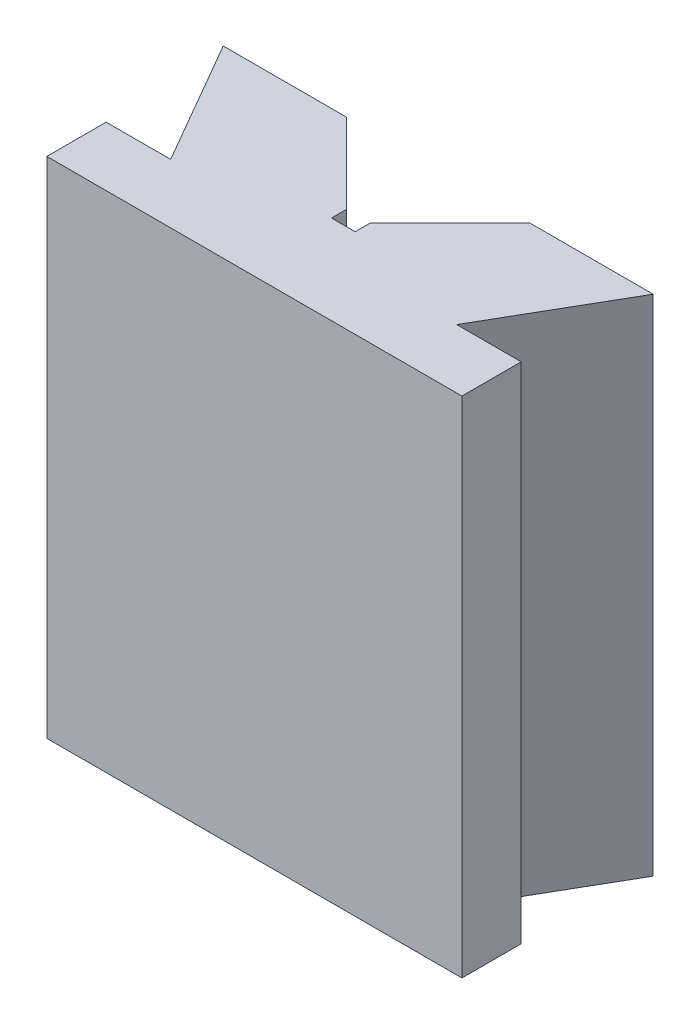
ISO-10303-21;
HEADER;
FILE_DESCRIPTION(('STEP AP214'),'2;1');
FILE_NAME('part.step','',(''),(''),'','','');
FILE_SCHEMA(('AUTOMOTIVE_DESIGN { 1 0 10303 214 1 1 1 1 }'));
ENDSEC;
DATA;
#1=APPLICATION_CONTEXT('core data for automotive mechanical design processes');
#2=APPLICATION_PROTOCOL_DEFINITION('international standard','automotive_design',2000,#1);
#3=PRODUCT_CONTEXT('',#1,'mechanical');
#4=PRODUCT('Part','Part','',(#3));
#5=PRODUCT_RELATED_PRODUCT_CATEGORY('part','',(#4));
#6=PRODUCT_DEFINITION_FORMATION('','',#4);
#7=PRODUCT_DEFINITION_CONTEXT('part definition',#1,'design');
#8=PRODUCT_DEFINITION('design','',#6,#7);
#9=PRODUCT_DEFINITION_SHAPE('','',#8);
#10=(LENGTH_UNIT() NAMED_UNIT(*) SI_UNIT(.MILLI.,.METRE.));
#11=(NAMED_UNIT(*) PLANE_ANGLE_UNIT() SI_UNIT($,.RADIAN.));
#12=(NAMED_UNIT(*) SI_UNIT($,.STERADIAN.) SOLID_ANGLE_UNIT());
#13=UNCERTAINTY_MEASURE_WITH_UNIT(LENGTH_MEASURE(1.E-05),#10,'distance_accuracy_value','');
#14=(GEOMETRIC_REPRESENTATION_CONTEXT(3) GLOBAL_UNCERTAINTY_ASSIGNED_CONTEXT((#13)) GLOBAL_UNIT_ASSIGNED_CONTEXT((#10,
#11,#12)) REPRESENTATION_CONTEXT('',''));
#15=CARTESIAN_POINT('',(0.,0.,0.));
#16=DIRECTION('',(0.,0.,1.));
#17=DIRECTION('',(1.,0.,0.));
#18=AXIS2_PLACEMENT_3D('',#15,#16,#17);
#19=CARTESIAN_POINT('',(-2.49999999999999,170.,-62.));
#20=DIRECTION('',(0.,0.,-1.));
#21=DIRECTION('',(-1.,0.,0.));
#22=AXIS2_PLACEMENT_3D('',#19,#20,#21);
#23=PLANE('',#22);
#24=DIRECTION('',(1.,0.,0.));
#25=VECTOR('',#24,1.);
#26=CARTESIAN_POINT('',(-2.49999999999999,0.,-62.));
#27=LINE('',#26,#25);
#28=CARTESIAN_POINT('',(-2.49999999999999,0.,-62.));
#29=VERTEX_POINT('',#28);
#30=CARTESIAN_POINT('',(38.9999999999999,0.,-62.));
#31=VERTEX_POINT('',#30);
#32=EDGE_CURVE('E167',#29,#31,#27,.T.);
#33=ORIENTED_EDGE('',*,*,#32,.F.);
#34=DIRECTION('',(0.,-1.,0.));
#35=VECTOR('',#34,1.);
#36=CARTESIAN_POINT('',(-2.49999999999999,170.,-62.));
#37=LINE('',#36,#35);
#38=CARTESIAN_POINT('',(-2.49999999999999,170.,-62.));
#39=VERTEX_POINT('',#38);
#40=EDGE_CURVE('E11',#39,#29,#37,.T.);
#41=ORIENTED_EDGE('',*,*,#40,.F.);
#42=DIRECTION('',(1.,0.,0.));
#43=VECTOR('',#42,1.);
#44=CARTESIAN_POINT('',(-2.49999999999999,170.,-62.));
#45=LINE('',#44,#43);
#46=CARTESIAN_POINT('',(38.9999999999999,170.,-62.));
#47=VERTEX_POINT('',#46);
#48=EDGE_CURVE('E199',#39,#47,#45,.T.);
#49=ORIENTED_EDGE('',*,*,#48,.T.);
#50=DIRECTION('',(0.,-1.,0.));
#51=VECTOR('',#50,1.);
#52=CARTESIAN_POINT('',(38.9999999999999,170.,-62.));
#53=LINE('',#52,#51);
#54=EDGE_CURVE('E38',#47,#31,#53,.T.);
#55=ORIENTED_EDGE('',*,*,#54,.T.);
#56=EDGE_LOOP('',(#33,#41,#49,#55));
#57=FACE_BOUND('',#56,.T.);
#58=ADVANCED_FACE('F35',(#57),#23,.T.);
#59=CARTESIAN_POINT('',(21.7487113059646,170.,-20.));
#60=DIRECTION('',(-0.866025403784436,0.,0.500000000000004));
#61=DIRECTION('',(0.500000000000004,0.,0.866025403784436));
#62=AXIS2_PLACEMENT_3D('',#59,#60,#61);
#63=PLANE('',#62);
#64=DIRECTION('',(-0.500000000000004,0.,-0.866025403784436));
#65=VECTOR('',#64,1.);
#66=CARTESIAN_POINT('',(21.7487113059646,0.,-20.));
#67=LINE('',#66,#65);
#68=CARTESIAN_POINT('',(21.7487113059646,0.,-20.));
#69=VERTEX_POINT('',#68);
#70=EDGE_CURVE('E197',#69,#29,#67,.T.);
#71=ORIENTED_EDGE('',*,*,#70,.F.);
#72=DIRECTION('',(0.,-1.,0.));
#73=VECTOR('',#72,1.);
#74=CARTESIAN_POINT('',(21.7487113059646,170.,-20.));
#75=LINE('',#74,#73);
#76=CARTESIAN_POINT('',(21.7487113059646,170.,-20.));
#77=VERTEX_POINT('',#76);
#78=EDGE_CURVE('E44',#77,#69,#75,.T.);
#79=ORIENTED_EDGE('',*,*,#78,.F.);
#80=DIRECTION('',(-0.500000000000004,0.,-0.866025403784436));
#81=VECTOR('',#80,1.);
#82=CARTESIAN_POINT('',(21.7487113059646,170.,-20.));
#83=LINE('',#82,#81);
#84=EDGE_CURVE('E156',#77,#39,#83,.T.);
#85=ORIENTED_EDGE('',*,*,#84,.T.);
#86=ORIENTED_EDGE('',*,*,#40,.T.);
#87=EDGE_LOOP('',(#71,#79,#85,#86));
#88=FACE_BOUND('',#87,.T.);
#89=ADVANCED_FACE('F229',(#88),#63,.T.);
#90=CARTESIAN_POINT('',(0.,170.,-20.));
#91=DIRECTION('',(0.,0.,-1.));
#92=DIRECTION('',(-1.,0.,0.));
#93=AXIS2_PLACEMENT_3D('',#90,#91,#92);
#94=PLANE('',#93);
#95=DIRECTION('',(1.,0.,0.));
#96=VECTOR('',#95,1.);
#97=CARTESIAN_POINT('',(0.,0.,-20.));
#98=LINE('',#97,#96);
#99=CARTESIAN_POINT('',(0.,0.,-20.));
#100=VERTEX_POINT('',#99);
#101=EDGE_CURVE('E145',#100,#69,#98,.T.);
#102=ORIENTED_EDGE('',*,*,#101,.F.);
#103=DIRECTION('',(0.,-1.,0.));
#104=VECTOR('',#103,1.);
#105=CARTESIAN_POINT('',(0.,170.,-20.));
#106=LINE('',#105,#104);
#107=CARTESIAN_POINT('',(0.,170.,-20.));
#108=VERTEX_POINT('',#107);
#109=EDGE_CURVE('E140',#108,#100,#106,.T.);
#110=ORIENTED_EDGE('',*,*,#109,.F.);
#111=DIRECTION('',(1.,0.,0.));
#112=VECTOR('',#111,1.);
#113=CARTESIAN_POINT('',(0.,170.,-20.));
#114=LINE('',#113,#112);
#115=EDGE_CURVE('E143',#108,#77,#114,.T.);
#116=ORIENTED_EDGE('',*,*,#115,.T.);
#117=ORIENTED_EDGE('',*,*,#78,.T.);
#118=EDGE_LOOP('',(#102,#110,#116,#117));
#119=FACE_BOUND('',#118,.T.);
#120=ADVANCED_FACE('F142',(#119),#94,.T.);
#121=CARTESIAN_POINT('',(0.,170.,0.));
#122=DIRECTION('',(-1.,0.,0.));
#123=DIRECTION('',(0.,0.,1.));
#124=AXIS2_PLACEMENT_3D('',#121,#122,#123);
#125=PLANE('',#124);
#126=DIRECTION('',(0.,0.,-1.));
#127=VECTOR('',#126,1.);
#128=CARTESIAN_POINT('',(0.,0.,0.));
#129=LINE('',#128,#127);
#130=CARTESIAN_POINT('',(0.,0.,0.));
#131=VERTEX_POINT('',#130);
#132=EDGE_CURVE('E194',#131,#100,#129,.T.);
#133=ORIENTED_EDGE('',*,*,#132,.F.);
#134=DIRECTION('',(0.,-1.,0.));
#135=VECTOR('',#134,1.);
#136=CARTESIAN_POINT('',(0.,170.,0.));
#137=LINE('',#136,#135);
#138=CARTESIAN_POINT('',(0.,170.,0.));
#139=VERTEX_POINT('',#138);
#140=EDGE_CURVE('E150',#139,#131,#137,.T.);
#141=ORIENTED_EDGE('',*,*,#140,.F.);
#142=DIRECTION('',(0.,0.,-1.));
#143=VECTOR('',#142,1.);
#144=CARTESIAN_POINT('',(0.,170.,0.));
#145=LINE('',#144,#143);
#146=EDGE_CURVE('E155',#139,#108,#145,.T.);
#147=ORIENTED_EDGE('',*,*,#146,.T.);
#148=ORIENTED_EDGE('',*,*,#109,.T.);
#149=EDGE_LOOP('',(#133,#141,#147,#148));
#150=FACE_BOUND('',#149,.T.);
#151=ADVANCED_FACE('F158',(#150),#125,.T.);
#152=CARTESIAN_POINT('',(0.,170.,0.));
#153=DIRECTION('',(0.,0.,-1.));
#154=DIRECTION('',(-1.,0.,0.));
#155=AXIS2_PLACEMENT_3D('',#152,#153,#154);
#156=PLANE('',#155);
#157=DIRECTION('',(1.,0.,0.));
#158=VECTOR('',#157,1.);
#159=CARTESIAN_POINT('',(0.,0.,0.));
#160=LINE('',#159,#158);
#161=CARTESIAN_POINT('',(140.,0.,0.));
#162=VERTEX_POINT('',#161);
#163=EDGE_CURVE('E192',#131,#162,#160,.T.);
#164=ORIENTED_EDGE('',*,*,#163,.T.);
#165=DIRECTION('',(0.,-1.,0.));
#166=VECTOR('',#165,1.);
#167=CARTESIAN_POINT('',(140.,170.,0.));
#168=LINE('',#167,#166);
#169=CARTESIAN_POINT('',(140.,170.,0.));
#170=VERTEX_POINT('',#169);
#171=EDGE_CURVE('E203',#170,#162,#168,.T.);
#172=ORIENTED_EDGE('',*,*,#171,.F.);
#173=DIRECTION('',(1.,0.,0.));
#174=VECTOR('',#173,1.);
#175=CARTESIAN_POINT('',(0.,170.,0.));
#176=LINE('',#175,#174);
#177=EDGE_CURVE('E160',#139,#170,#176,.T.);
#178=ORIENTED_EDGE('',*,*,#177,.F.);
#179=ORIENTED_EDGE('',*,*,#140,.T.);
#180=EDGE_LOOP('',(#164,#172,#178,#179));
#181=FACE_BOUND('',#180,.T.);
#182=ADVANCED_FACE('F242',(#181),#156,.F.);
#183=CARTESIAN_POINT('',(140.,170.,0.));
#184=DIRECTION('',(-1.,0.,0.));
#185=DIRECTION('',(0.,0.,1.));
#186=AXIS2_PLACEMENT_3D('',#183,#184,#185);
#187=PLANE('',#186);
#188=DIRECTION('',(0.,0.,-1.));
#189=VECTOR('',#188,1.);
#190=CARTESIAN_POINT('',(140.,0.,0.));
#191=LINE('',#190,#189);
#192=CARTESIAN_POINT('',(140.,0.,-20.));
#193=VERTEX_POINT('',#192);
#194=EDGE_CURVE('E190',#162,#193,#191,.T.);
#195=ORIENTED_EDGE('',*,*,#194,.T.);
#196=DIRECTION('',(0.,-1.,0.));
#197=VECTOR('',#196,1.);
#198=CARTESIAN_POINT('',(140.,170.,-20.));
#199=LINE('',#198,#197);
#200=CARTESIAN_POINT('',(140.,170.,-20.));
#201=VERTEX_POINT('',#200);
#202=EDGE_CURVE('E206',#201,#193,#199,.T.);
#203=ORIENTED_EDGE('',*,*,#202,.F.);
#204=DIRECTION('',(0.,0.,-1.));
#205=VECTOR('',#204,1.);
#206=CARTESIAN_POINT('',(140.,170.,0.));
#207=LINE('',#206,#205);
#208=EDGE_CURVE('E162',#170,#201,#207,.T.);
#209=ORIENTED_EDGE('',*,*,#208,.F.);
#210=ORIENTED_EDGE('',*,*,#171,.T.);
#211=EDGE_LOOP('',(#195,#203,#209,#210));
#212=FACE_BOUND('',#211,.T.);
#213=ADVANCED_FACE('F245',(#212),#187,.F.);
#214=CARTESIAN_POINT('',(140.,170.,-20.));
#215=DIRECTION('',(0.,0.,1.));
#216=DIRECTION('',(1.,0.,0.));
#217=AXIS2_PLACEMENT_3D('',#214,#215,#216);
#218=PLANE('',#217);
#219=DIRECTION('',(-1.,0.,0.));
#220=VECTOR('',#219,1.);
#221=CARTESIAN_POINT('',(140.,0.,-20.));
#222=LINE('',#221,#220);
#223=CARTESIAN_POINT('',(118.251288694035,0.,-20.));
#224=VERTEX_POINT('',#223);
#225=EDGE_CURVE('E188',#193,#224,#222,.T.);
#226=ORIENTED_EDGE('',*,*,#225,.T.);
#227=DIRECTION('',(0.,-1.,0.));
#228=VECTOR('',#227,1.);
#229=CARTESIAN_POINT('',(118.251288694035,170.,-20.));
#230=LINE('',#229,#228);
#231=CARTESIAN_POINT('',(118.251288694035,170.,-20.));
#232=VERTEX_POINT('',#231);
#233=EDGE_CURVE('E209',#232,#224,#230,.T.);
#234=ORIENTED_EDGE('',*,*,#233,.F.);
#235=DIRECTION('',(-1.,0.,0.));
#236=VECTOR('',#235,1.);
#237=CARTESIAN_POINT('',(140.,170.,-20.));
#238=LINE('',#237,#236);
#239=EDGE_CURVE('E399',#201,#232,#238,.T.);
#240=ORIENTED_EDGE('',*,*,#239,.F.);
#241=ORIENTED_EDGE('',*,*,#202,.T.);
#242=EDGE_LOOP('',(#226,#234,#240,#241));
#243=FACE_BOUND('',#242,.T.);
#244=ADVANCED_FACE('F249',(#243),#218,.F.);
#245=CARTESIAN_POINT('',(118.251288694035,170.,-20.));
#246=DIRECTION('',(-0.866025403784436,0.,-0.500000000000004));
#247=DIRECTION('',(-0.500000000000004,0.,0.866025403784436));
#248=AXIS2_PLACEMENT_3D('',#245,#246,#247);
#249=PLANE('',#248);
#250=DIRECTION('',(0.500000000000004,0.,-0.866025403784436));
#251=VECTOR('',#250,1.);
#252=CARTESIAN_POINT('',(118.251288694035,0.,-20.));
#253=LINE('',#252,#251);
#254=CARTESIAN_POINT('',(142.5,0.,-62.));
#255=VERTEX_POINT('',#254);
#256=EDGE_CURVE('E186',#224,#255,#253,.T.);
#257=ORIENTED_EDGE('',*,*,#256,.T.);
#258=DIRECTION('',(0.,-1.,0.));
#259=VECTOR('',#258,1.);
#260=CARTESIAN_POINT('',(142.5,170.,-62.));
#261=LINE('',#260,#259);
#262=CARTESIAN_POINT('',(142.5,170.,-62.));
#263=VERTEX_POINT('',#262);
#264=EDGE_CURVE('E212',#263,#255,#261,.T.);
#265=ORIENTED_EDGE('',*,*,#264,.F.);
#266=DIRECTION('',(0.500000000000004,0.,-0.866025403784436));
#267=VECTOR('',#266,1.);
#268=CARTESIAN_POINT('',(118.251288694035,170.,-20.));
#269=LINE('',#268,#267);
#270=EDGE_CURVE('E396',#232,#263,#269,.T.);
#271=ORIENTED_EDGE('',*,*,#270,.F.);
#272=ORIENTED_EDGE('',*,*,#233,.T.);
#273=EDGE_LOOP('',(#257,#265,#271,#272));
#274=FACE_BOUND('',#273,.T.);
#275=ADVANCED_FACE('F253',(#274),#249,.F.);
#276=CARTESIAN_POINT('',(142.5,170.,-62.));
#277=DIRECTION('',(0.,0.,1.));
#278=DIRECTION('',(1.,0.,0.));
#279=AXIS2_PLACEMENT_3D('',#276,#277,#278);
#280=PLANE('',#279);
#281=DIRECTION('',(-1.,0.,0.));
#282=VECTOR('',#281,1.);
#283=CARTESIAN_POINT('',(142.5,0.,-62.));
#284=LINE('',#283,#282);
#285=CARTESIAN_POINT('',(101.,0.,-62.));
#286=VERTEX_POINT('',#285);
#287=EDGE_CURVE('E184',#255,#286,#284,.T.);
#288=ORIENTED_EDGE('',*,*,#287,.T.);
#289=DIRECTION('',(0.,-1.,0.));
#290=VECTOR('',#289,1.);
#291=CARTESIAN_POINT('',(101.,170.,-62.));
#292=LINE('',#291,#290);
#293=CARTESIAN_POINT('',(101.,170.,-62.));
#294=VERTEX_POINT('',#293);
#295=EDGE_CURVE('E215',#294,#286,#292,.T.);
#296=ORIENTED_EDGE('',*,*,#295,.F.);
#297=DIRECTION('',(-1.,0.,0.));
#298=VECTOR('',#297,1.);
#299=CARTESIAN_POINT('',(142.5,170.,-62.));
#300=LINE('',#299,#298);
#301=EDGE_CURVE('E394',#263,#294,#300,.T.);
#302=ORIENTED_EDGE('',*,*,#301,.F.);
#303=ORIENTED_EDGE('',*,*,#264,.T.);
#304=EDGE_LOOP('',(#288,#296,#302,#303));
#305=FACE_BOUND('',#304,.T.);
#306=ADVANCED_FACE('F257',(#305),#280,.F.);
#307=CARTESIAN_POINT('',(101.,170.,-62.));
#308=DIRECTION('',(0.707106781186546,0.,0.707106781186549));
#309=DIRECTION('',(0.707106781186549,0.,-0.707106781186546));
#310=AXIS2_PLACEMENT_3D('',#307,#308,#309);
#311=PLANE('',#310);
#312=DIRECTION('',(-0.707106781186549,0.,0.707106781186546));
#313=VECTOR('',#312,1.);
#314=CARTESIAN_POINT('',(101.,0.,-62.));
#315=LINE('',#314,#313);
#316=CARTESIAN_POINT('',(74.,0.,-35.));
#317=VERTEX_POINT('',#316);
#318=EDGE_CURVE('E182',#286,#317,#315,.T.);
#319=ORIENTED_EDGE('',*,*,#318,.T.);
#320=DIRECTION('',(0.,-1.,0.));
#321=VECTOR('',#320,1.);
#322=CARTESIAN_POINT('',(74.,170.,-35.));
#323=LINE('',#322,#321);
#324=CARTESIAN_POINT('',(74.,170.,-35.));
#325=VERTEX_POINT('',#324);
#326=EDGE_CURVE('E218',#325,#317,#323,.T.);
#327=ORIENTED_EDGE('',*,*,#326,.F.);
#328=DIRECTION('',(-0.707106781186549,0.,0.707106781186546));
#329=VECTOR('',#328,1.);
#330=CARTESIAN_POINT('',(101.,170.,-62.));
#331=LINE('',#330,#329);
#332=EDGE_CURVE('E387',#294,#325,#331,.T.);
#333=ORIENTED_EDGE('',*,*,#332,.F.);
#334=ORIENTED_EDGE('',*,*,#295,.T.);
#335=EDGE_LOOP('',(#319,#327,#333,#334));
#336=FACE_BOUND('',#335,.T.);
#337=ADVANCED_FACE('F261',(#336),#311,.F.);
#338=CARTESIAN_POINT('',(74.,170.,-35.));
#339=DIRECTION('',(1.,0.,0.));
#340=DIRECTION('',(0.,0.,-1.));
#341=AXIS2_PLACEMENT_3D('',#338,#339,#340);
#342=PLANE('',#341);
#343=DIRECTION('',(0.,0.,1.));
#344=VECTOR('',#343,1.);
#345=CARTESIAN_POINT('',(74.,0.,-35.));
#346=LINE('',#345,#344);
#347=CARTESIAN_POINT('',(74.,0.,-30.));
#348=VERTEX_POINT('',#347);
#349=EDGE_CURVE('E179',#317,#348,#346,.T.);
#350=ORIENTED_EDGE('',*,*,#349,.T.);
#351=DIRECTION('',(0.,-1.,0.));
#352=VECTOR('',#351,1.);
#353=CARTESIAN_POINT('',(74.,170.,-30.));
#354=LINE('',#353,#352);
#355=CARTESIAN_POINT('',(74.,170.,-30.));
#356=VERTEX_POINT('',#355);
#357=EDGE_CURVE('E221',#356,#348,#354,.T.);
#358=ORIENTED_EDGE('',*,*,#357,.F.);
#359=DIRECTION('',(0.,0.,1.));
#360=VECTOR('',#359,1.);
#361=CARTESIAN_POINT('',(74.,170.,-35.));
#362=LINE('',#361,#360);
#363=EDGE_CURVE('E385',#325,#356,#362,.T.);
#364=ORIENTED_EDGE('',*,*,#363,.F.);
#365=ORIENTED_EDGE('',*,*,#326,.T.);
#366=EDGE_LOOP('',(#350,#358,#364,#365));
#367=FACE_BOUND('',#366,.T.);
#368=ADVANCED_FACE('F265',(#367),#342,.F.);
#369=CARTESIAN_POINT('',(66.,170.,-30.));
#370=DIRECTION('',(0.,0.,-1.));
#371=DIRECTION('',(-1.,0.,0.));
#372=AXIS2_PLACEMENT_3D('',#369,#370,#371);
#373=PLANE('',#372);
#374=DIRECTION('',(1.,0.,0.));
#375=VECTOR('',#374,1.);
#376=CARTESIAN_POINT('',(66.,0.,-30.));
#377=LINE('',#376,#375);
#378=CARTESIAN_POINT('',(66.,0.,-30.));
#379=VERTEX_POINT('',#378);
#380=EDGE_CURVE('E176',#379,#348,#377,.T.);
#381=ORIENTED_EDGE('',*,*,#380,.F.);
#382=DIRECTION('',(0.,-1.,0.));
#383=VECTOR('',#382,1.);
#384=CARTESIAN_POINT('',(66.,170.,-30.));
#385=LINE('',#384,#383);
#386=CARTESIAN_POINT('',(66.,170.,-30.));
#387=VERTEX_POINT('',#386);
#388=EDGE_CURVE('E223',#387,#379,#385,.T.);
#389=ORIENTED_EDGE('',*,*,#388,.F.);
#390=DIRECTION('',(1.,0.,0.));
#391=VECTOR('',#390,1.);
#392=CARTESIAN_POINT('',(66.,170.,-30.));
#393=LINE('',#392,#391);
#394=EDGE_CURVE('E382',#387,#356,#393,.T.);
#395=ORIENTED_EDGE('',*,*,#394,.T.);
#396=ORIENTED_EDGE('',*,*,#357,.T.);
#397=EDGE_LOOP('',(#381,#389,#395,#396));
#398=FACE_BOUND('',#397,.T.);
#399=ADVANCED_FACE('F269',(#398),#373,.T.);
#400=CARTESIAN_POINT('',(66.,170.,-35.));
#401=DIRECTION('',(1.,0.,0.));
#402=DIRECTION('',(0.,0.,-1.));
#403=AXIS2_PLACEMENT_3D('',#400,#401,#402);
#404=PLANE('',#403);
#405=DIRECTION('',(0.,0.,1.));
#406=VECTOR('',#405,1.);
#407=CARTESIAN_POINT('',(66.,0.,-35.));
#408=LINE('',#407,#406);
#409=CARTESIAN_POINT('',(66.,0.,-35.));
#410=VERTEX_POINT('',#409);
#411=EDGE_CURVE('E173',#410,#379,#408,.T.);
#412=ORIENTED_EDGE('',*,*,#411,.F.);
#413=DIRECTION('',(0.,-1.,0.));
#414=VECTOR('',#413,1.);
#415=CARTESIAN_POINT('',(66.,170.,-35.));
#416=LINE('',#415,#414);
#417=CARTESIAN_POINT('',(66.,170.,-35.));
#418=VERTEX_POINT('',#417);
#419=EDGE_CURVE('E224',#418,#410,#416,.T.);
#420=ORIENTED_EDGE('',*,*,#419,.F.);
#421=DIRECTION('',(0.,0.,1.));
#422=VECTOR('',#421,1.);
#423=CARTESIAN_POINT('',(66.,170.,-35.));
#424=LINE('',#423,#422);
#425=EDGE_CURVE('E412',#418,#387,#424,.T.);
#426=ORIENTED_EDGE('',*,*,#425,.T.);
#427=ORIENTED_EDGE('',*,*,#388,.T.);
#428=EDGE_LOOP('',(#412,#420,#426,#427));
#429=FACE_BOUND('',#428,.T.);
#430=ADVANCED_FACE('F273',(#429),#404,.T.);
#431=CARTESIAN_POINT('',(38.9999999999999,170.,-62.));
#432=DIRECTION('',(0.707106781186546,0.,-0.707106781186549));
#433=DIRECTION('',(-0.707106781186549,0.,-0.707106781186546));
#434=AXIS2_PLACEMENT_3D('',#431,#432,#433);
#435=PLANE('',#434);
#436=DIRECTION('',(0.707106781186549,0.,0.707106781186546));
#437=VECTOR('',#436,1.);
#438=CARTESIAN_POINT('',(38.9999999999999,0.,-62.));
#439=LINE('',#438,#437);
#440=EDGE_CURVE('E170',#31,#410,#439,.T.);
#441=ORIENTED_EDGE('',*,*,#440,.F.);
#442=ORIENTED_EDGE('',*,*,#54,.F.);
#443=DIRECTION('',(0.707106781186549,0.,0.707106781186546));
#444=VECTOR('',#443,1.);
#445=CARTESIAN_POINT('',(38.9999999999999,170.,-62.));
#446=LINE('',#445,#444);
#447=EDGE_CURVE('E414',#47,#418,#446,.T.);
#448=ORIENTED_EDGE('',*,*,#447,.T.);
#449=ORIENTED_EDGE('',*,*,#419,.T.);
#450=EDGE_LOOP('',(#441,#442,#448,#449));
#451=FACE_BOUND('',#450,.T.);
#452=ADVANCED_FACE('F226',(#451),#435,.T.);
#453=CARTESIAN_POINT('',(0.,170.,0.));
#454=DIRECTION('',(0.,-1.,0.));
#455=DIRECTION('',(0.,0.,-1.));
#456=AXIS2_PLACEMENT_3D('',#453,#454,#455);
#457=PLANE('',#456);
#458=ORIENTED_EDGE('',*,*,#48,.F.);
#459=ORIENTED_EDGE('',*,*,#84,.F.);
#460=ORIENTED_EDGE('',*,*,#115,.F.);
#461=ORIENTED_EDGE('',*,*,#146,.F.);
#462=ORIENTED_EDGE('',*,*,#177,.T.);
#463=ORIENTED_EDGE('',*,*,#208,.T.);
#464=ORIENTED_EDGE('',*,*,#239,.T.);
#465=ORIENTED_EDGE('',*,*,#270,.T.);
#466=ORIENTED_EDGE('',*,*,#301,.T.);
#467=ORIENTED_EDGE('',*,*,#332,.T.);
#468=ORIENTED_EDGE('',*,*,#363,.T.);
#469=ORIENTED_EDGE('',*,*,#394,.F.);
#470=ORIENTED_EDGE('',*,*,#425,.F.);
#471=ORIENTED_EDGE('',*,*,#447,.F.);
#472=EDGE_LOOP('',(#458,#459,#460,#461,#462,#463,#464,#465,#466,#467,#468,#469,#470,#471));
#473=FACE_BOUND('',#472,.T.);
#474=ADVANCED_FACE('F154',(#473),#457,.F.);
#475=CARTESIAN_POINT('',(0.,0.,0.));
#476=DIRECTION('',(0.,-1.,0.));
#477=DIRECTION('',(0.,0.,-1.));
#478=AXIS2_PLACEMENT_3D('',#475,#476,#477);
#479=PLANE('',#478);
#480=ORIENTED_EDGE('',*,*,#32,.T.);
#481=ORIENTED_EDGE('',*,*,#440,.T.);
#482=ORIENTED_EDGE('',*,*,#411,.T.);
#483=ORIENTED_EDGE('',*,*,#380,.T.);
#484=ORIENTED_EDGE('',*,*,#349,.F.);
#485=ORIENTED_EDGE('',*,*,#318,.F.);
#486=ORIENTED_EDGE('',*,*,#287,.F.);
#487=ORIENTED_EDGE('',*,*,#256,.F.);
#488=ORIENTED_EDGE('',*,*,#225,.F.);
#489=ORIENTED_EDGE('',*,*,#194,.F.);
#490=ORIENTED_EDGE('',*,*,#163,.F.);
#491=ORIENTED_EDGE('',*,*,#132,.T.);
#492=ORIENTED_EDGE('',*,*,#101,.T.);
#493=ORIENTED_EDGE('',*,*,#70,.T.);
#494=EDGE_LOOP('',(#480,#481,#482,#483,#484,#485,#486,#487,#488,#489,#490,#491,#492,#493));
#495=FACE_BOUND('',#494,.T.);
#496=ADVANCED_FACE('F228',(#495),#479,.T.);
#497=CLOSED_SHELL('',(#58,#89,#120,#151,#182,#213,#244,#275,#306,#337,#368,#399,#430,#452,#474,#496));
#498=MANIFOLD_SOLID_BREP('B2',#497);
#499=ADVANCED_BREP_SHAPE_REPRESENTATION('',(#18,#498),#14);
#500=SHAPE_DEFINITION_REPRESENTATION(#9,#499);
ENDSEC;
END-ISO-10303-21;
